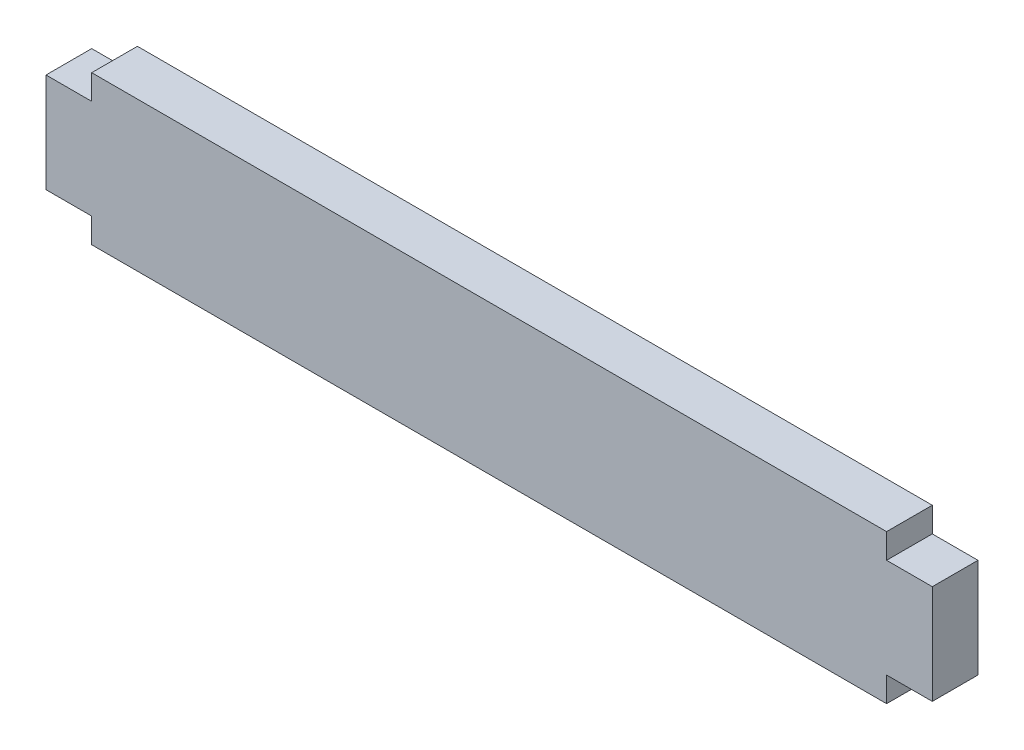
ISO-10303-21;
HEADER;
FILE_DESCRIPTION(('STEP AP214'),'2;1');
FILE_NAME('part.step','',(''),(''),'','','');
FILE_SCHEMA(('AUTOMOTIVE_DESIGN { 1 0 10303 214 1 1 1 1 }'));
ENDSEC;
DATA;
#1=APPLICATION_CONTEXT('core data for automotive mechanical design processes');
#2=APPLICATION_PROTOCOL_DEFINITION('international standard','automotive_design',2000,#1);
#3=PRODUCT_CONTEXT('',#1,'mechanical');
#4=PRODUCT('Part','Part','',(#3));
#5=PRODUCT_RELATED_PRODUCT_CATEGORY('part','',(#4));
#6=PRODUCT_DEFINITION_FORMATION('','',#4);
#7=PRODUCT_DEFINITION_CONTEXT('part definition',#1,'design');
#8=PRODUCT_DEFINITION('design','',#6,#7);
#9=PRODUCT_DEFINITION_SHAPE('','',#8);
#10=(LENGTH_UNIT() NAMED_UNIT(*) SI_UNIT(.MILLI.,.METRE.));
#11=(NAMED_UNIT(*) PLANE_ANGLE_UNIT() SI_UNIT($,.RADIAN.));
#12=(NAMED_UNIT(*) SI_UNIT($,.STERADIAN.) SOLID_ANGLE_UNIT());
#13=UNCERTAINTY_MEASURE_WITH_UNIT(LENGTH_MEASURE(1.E-05),#10,'distance_accuracy_value','');
#14=(GEOMETRIC_REPRESENTATION_CONTEXT(3) GLOBAL_UNCERTAINTY_ASSIGNED_CONTEXT((#13)) GLOBAL_UNIT_ASSIGNED_CONTEXT((#10,
#11,#12)) REPRESENTATION_CONTEXT('',''));
#15=CARTESIAN_POINT('',(0.,0.,0.));
#16=DIRECTION('',(0.,0.,1.));
#17=DIRECTION('',(1.,0.,0.));
#18=AXIS2_PLACEMENT_3D('',#15,#16,#17);
#19=CARTESIAN_POINT('',(0.,6.35,5.842));
#20=DIRECTION('',(0.,-1.,0.));
#21=DIRECTION('',(0.,0.,-1.));
#22=AXIS2_PLACEMENT_3D('',#19,#20,#21);
#23=PLANE('',#22);
#24=DIRECTION('',(-1.,0.,0.));
#25=VECTOR('',#24,1.);
#26=CARTESIAN_POINT('',(0.,6.35,0.));
#27=LINE('',#26,#25);
#28=CARTESIAN_POINT('',(56.642,6.35,0.));
#29=VERTEX_POINT('',#28);
#30=CARTESIAN_POINT('',(50.8,6.35,0.));
#31=VERTEX_POINT('',#30);
#32=EDGE_CURVE('E154',#29,#31,#27,.T.);
#33=ORIENTED_EDGE('',*,*,#32,.T.);
#34=DIRECTION('',(0.,0.,-1.));
#35=VECTOR('',#34,1.);
#36=CARTESIAN_POINT('',(50.8,6.35,5.842));
#37=LINE('',#36,#35);
#38=CARTESIAN_POINT('',(50.8,6.35,5.842));
#39=VERTEX_POINT('',#38);
#40=EDGE_CURVE('E11',#39,#31,#37,.T.);
#41=ORIENTED_EDGE('',*,*,#40,.F.);
#42=DIRECTION('',(-1.,0.,0.));
#43=VECTOR('',#42,1.);
#44=CARTESIAN_POINT('',(0.,6.35,5.842));
#45=LINE('',#44,#43);
#46=CARTESIAN_POINT('',(56.642,6.35,5.842));
#47=VERTEX_POINT('',#46);
#48=EDGE_CURVE('E184',#47,#39,#45,.T.);
#49=ORIENTED_EDGE('',*,*,#48,.F.);
#50=DIRECTION('',(0.,0.,-1.));
#51=VECTOR('',#50,1.);
#52=CARTESIAN_POINT('',(56.642,6.35,5.842));
#53=LINE('',#52,#51);
#54=EDGE_CURVE('E150',#47,#29,#53,.T.);
#55=ORIENTED_EDGE('',*,*,#54,.T.);
#56=EDGE_LOOP('',(#33,#41,#49,#55));
#57=FACE_BOUND('',#56,.T.);
#58=ADVANCED_FACE('F35',(#57),#23,.F.);
#59=CARTESIAN_POINT('',(50.7999999999999,-1.11022302462516E-13,5.842));
#60=DIRECTION('',(-1.,0.,0.));
#61=DIRECTION('',(0.,-1.,0.));
#62=AXIS2_PLACEMENT_3D('',#59,#60,#61);
#63=PLANE('',#62);
#64=DIRECTION('',(0.,1.,0.));
#65=VECTOR('',#64,1.);
#66=CARTESIAN_POINT('',(50.7999999999999,-1.11022302462516E-13,0.));
#67=LINE('',#66,#65);
#68=CARTESIAN_POINT('',(50.8,9.525,0.));
#69=VERTEX_POINT('',#68);
#70=EDGE_CURVE('E157',#31,#69,#67,.T.);
#71=ORIENTED_EDGE('',*,*,#70,.T.);
#72=DIRECTION('',(0.,0.,-1.));
#73=VECTOR('',#72,1.);
#74=CARTESIAN_POINT('',(50.8,9.525,5.842));
#75=LINE('',#74,#73);
#76=CARTESIAN_POINT('',(50.8,9.525,5.842));
#77=VERTEX_POINT('',#76);
#78=EDGE_CURVE('E43',#77,#69,#75,.T.);
#79=ORIENTED_EDGE('',*,*,#78,.F.);
#80=DIRECTION('',(0.,1.,0.));
#81=VECTOR('',#80,1.);
#82=CARTESIAN_POINT('',(50.7999999999999,-1.11022302462516E-13,5.842));
#83=LINE('',#82,#81);
#84=EDGE_CURVE('E102',#39,#77,#83,.T.);
#85=ORIENTED_EDGE('',*,*,#84,.F.);
#86=ORIENTED_EDGE('',*,*,#40,.T.);
#87=EDGE_LOOP('',(#71,#79,#85,#86));
#88=FACE_BOUND('',#87,.T.);
#89=ADVANCED_FACE('F249',(#88),#63,.F.);
#90=CARTESIAN_POINT('',(0.,9.52499999999999,5.842));
#91=DIRECTION('',(0.,-1.,0.));
#92=DIRECTION('',(1.,0.,0.));
#93=AXIS2_PLACEMENT_3D('',#90,#91,#92);
#94=PLANE('',#93);
#95=DIRECTION('',(-1.,0.,0.));
#96=VECTOR('',#95,1.);
#97=CARTESIAN_POINT('',(0.,9.52499999999999,0.));
#98=LINE('',#97,#96);
#99=CARTESIAN_POINT('',(-50.8,9.52499999999998,0.));
#100=VERTEX_POINT('',#99);
#101=EDGE_CURVE('E159',#69,#100,#98,.T.);
#102=ORIENTED_EDGE('',*,*,#101,.T.);
#103=DIRECTION('',(0.,0.,-1.));
#104=VECTOR('',#103,1.);
#105=CARTESIAN_POINT('',(-50.8,9.52499999999998,5.842));
#106=LINE('',#105,#104);
#107=CARTESIAN_POINT('',(-50.8,9.52499999999998,5.842));
#108=VERTEX_POINT('',#107);
#109=EDGE_CURVE('E198',#108,#100,#106,.T.);
#110=ORIENTED_EDGE('',*,*,#109,.F.);
#111=DIRECTION('',(-1.,0.,0.));
#112=VECTOR('',#111,1.);
#113=CARTESIAN_POINT('',(0.,9.52499999999999,5.842));
#114=LINE('',#113,#112);
#115=EDGE_CURVE('E205',#77,#108,#114,.T.);
#116=ORIENTED_EDGE('',*,*,#115,.F.);
#117=ORIENTED_EDGE('',*,*,#78,.T.);
#118=EDGE_LOOP('',(#102,#110,#116,#117));
#119=FACE_BOUND('',#118,.T.);
#120=ADVANCED_FACE('F203',(#119),#94,.F.);
#121=CARTESIAN_POINT('',(-50.8,0.,5.842));
#122=DIRECTION('',(-1.,0.,0.));
#123=DIRECTION('',(0.,0.,1.));
#124=AXIS2_PLACEMENT_3D('',#121,#122,#123);
#125=PLANE('',#124);
#126=DIRECTION('',(0.,1.,0.));
#127=VECTOR('',#126,1.);
#128=CARTESIAN_POINT('',(-50.8,0.,0.));
#129=LINE('',#128,#127);
#130=CARTESIAN_POINT('',(-50.8,6.35,0.));
#131=VERTEX_POINT('',#130);
#132=EDGE_CURVE('E162',#131,#100,#129,.T.);
#133=ORIENTED_EDGE('',*,*,#132,.F.);
#134=DIRECTION('',(0.,0.,-1.));
#135=VECTOR('',#134,1.);
#136=CARTESIAN_POINT('',(-50.8,6.35,5.842));
#137=LINE('',#136,#135);
#138=CARTESIAN_POINT('',(-50.8,6.35,5.842));
#139=VERTEX_POINT('',#138);
#140=EDGE_CURVE('E196',#139,#131,#137,.T.);
#141=ORIENTED_EDGE('',*,*,#140,.F.);
#142=DIRECTION('',(0.,1.,0.));
#143=VECTOR('',#142,1.);
#144=CARTESIAN_POINT('',(-50.8,0.,5.842));
#145=LINE('',#144,#143);
#146=EDGE_CURVE('E215',#139,#108,#145,.T.);
#147=ORIENTED_EDGE('',*,*,#146,.T.);
#148=ORIENTED_EDGE('',*,*,#109,.T.);
#149=EDGE_LOOP('',(#133,#141,#147,#148));
#150=FACE_BOUND('',#149,.T.);
#151=ADVANCED_FACE('F212',(#150),#125,.T.);
#152=CARTESIAN_POINT('',(0.,6.35,5.842));
#153=DIRECTION('',(0.,1.,0.));
#154=DIRECTION('',(0.,0.,1.));
#155=AXIS2_PLACEMENT_3D('',#152,#153,#154);
#156=PLANE('',#155);
#157=DIRECTION('',(1.,0.,0.));
#158=VECTOR('',#157,1.);
#159=CARTESIAN_POINT('',(0.,6.35,0.));
#160=LINE('',#159,#158);
#161=CARTESIAN_POINT('',(-56.642,6.35,0.));
#162=VERTEX_POINT('',#161);
#163=EDGE_CURVE('E165',#162,#131,#160,.T.);
#164=ORIENTED_EDGE('',*,*,#163,.F.);
#165=DIRECTION('',(0.,0.,-1.));
#166=VECTOR('',#165,1.);
#167=CARTESIAN_POINT('',(-56.642,6.35,5.842));
#168=LINE('',#167,#166);
#169=CARTESIAN_POINT('',(-56.642,6.35,5.842));
#170=VERTEX_POINT('',#169);
#171=EDGE_CURVE('E194',#170,#162,#168,.T.);
#172=ORIENTED_EDGE('',*,*,#171,.F.);
#173=DIRECTION('',(1.,0.,0.));
#174=VECTOR('',#173,1.);
#175=CARTESIAN_POINT('',(0.,6.35,5.842));
#176=LINE('',#175,#174);
#177=EDGE_CURVE('E218',#170,#139,#176,.T.);
#178=ORIENTED_EDGE('',*,*,#177,.T.);
#179=ORIENTED_EDGE('',*,*,#140,.T.);
#180=EDGE_LOOP('',(#164,#172,#178,#179));
#181=FACE_BOUND('',#180,.T.);
#182=ADVANCED_FACE('F260',(#181),#156,.T.);
#183=CARTESIAN_POINT('',(-56.642,0.,5.842));
#184=DIRECTION('',(-1.,0.,0.));
#185=DIRECTION('',(0.,0.,1.));
#186=AXIS2_PLACEMENT_3D('',#183,#184,#185);
#187=PLANE('',#186);
#188=DIRECTION('',(0.,1.,0.));
#189=VECTOR('',#188,1.);
#190=CARTESIAN_POINT('',(-56.642,0.,0.));
#191=LINE('',#190,#189);
#192=CARTESIAN_POINT('',(-56.642,-6.35,0.));
#193=VERTEX_POINT('',#192);
#194=EDGE_CURVE('E168',#193,#162,#191,.T.);
#195=ORIENTED_EDGE('',*,*,#194,.F.);
#196=DIRECTION('',(0.,0.,-1.));
#197=VECTOR('',#196,1.);
#198=CARTESIAN_POINT('',(-56.642,-6.35,5.842));
#199=LINE('',#198,#197);
#200=CARTESIAN_POINT('',(-56.642,-6.35,5.842));
#201=VERTEX_POINT('',#200);
#202=EDGE_CURVE('E192',#201,#193,#199,.T.);
#203=ORIENTED_EDGE('',*,*,#202,.F.);
#204=DIRECTION('',(0.,1.,0.));
#205=VECTOR('',#204,1.);
#206=CARTESIAN_POINT('',(-56.642,0.,5.842));
#207=LINE('',#206,#205);
#208=EDGE_CURVE('E220',#201,#170,#207,.T.);
#209=ORIENTED_EDGE('',*,*,#208,.T.);
#210=ORIENTED_EDGE('',*,*,#171,.T.);
#211=EDGE_LOOP('',(#195,#203,#209,#210));
#212=FACE_BOUND('',#211,.T.);
#213=ADVANCED_FACE('F263',(#212),#187,.T.);
#214=CARTESIAN_POINT('',(0.,-6.35,5.842));
#215=DIRECTION('',(0.,1.,0.));
#216=DIRECTION('',(0.,0.,1.));
#217=AXIS2_PLACEMENT_3D('',#214,#215,#216);
#218=PLANE('',#217);
#219=DIRECTION('',(1.,0.,0.));
#220=VECTOR('',#219,1.);
#221=CARTESIAN_POINT('',(0.,-6.35,0.));
#222=LINE('',#221,#220);
#223=CARTESIAN_POINT('',(-50.8,-6.35,0.));
#224=VERTEX_POINT('',#223);
#225=EDGE_CURVE('E171',#193,#224,#222,.T.);
#226=ORIENTED_EDGE('',*,*,#225,.T.);
#227=DIRECTION('',(0.,0.,-1.));
#228=VECTOR('',#227,1.);
#229=CARTESIAN_POINT('',(-50.8,-6.35,5.842));
#230=LINE('',#229,#228);
#231=CARTESIAN_POINT('',(-50.8,-6.35,5.842));
#232=VERTEX_POINT('',#231);
#233=EDGE_CURVE('E190',#232,#224,#230,.T.);
#234=ORIENTED_EDGE('',*,*,#233,.F.);
#235=DIRECTION('',(1.,0.,0.));
#236=VECTOR('',#235,1.);
#237=CARTESIAN_POINT('',(0.,-6.35,5.842));
#238=LINE('',#237,#236);
#239=EDGE_CURVE('E227',#201,#232,#238,.T.);
#240=ORIENTED_EDGE('',*,*,#239,.F.);
#241=ORIENTED_EDGE('',*,*,#202,.T.);
#242=EDGE_LOOP('',(#226,#234,#240,#241));
#243=FACE_BOUND('',#242,.T.);
#244=ADVANCED_FACE('F267',(#243),#218,.F.);
#245=CARTESIAN_POINT('',(-50.8,0.,5.842));
#246=DIRECTION('',(-1.,0.,0.));
#247=DIRECTION('',(0.,0.,1.));
#248=AXIS2_PLACEMENT_3D('',#245,#246,#247);
#249=PLANE('',#248);
#250=DIRECTION('',(0.,1.,0.));
#251=VECTOR('',#250,1.);
#252=CARTESIAN_POINT('',(-50.8,0.,0.));
#253=LINE('',#252,#251);
#254=CARTESIAN_POINT('',(-50.8,-9.52500000000001,0.));
#255=VERTEX_POINT('',#254);
#256=EDGE_CURVE('E174',#255,#224,#253,.T.);
#257=ORIENTED_EDGE('',*,*,#256,.F.);
#258=DIRECTION('',(0.,0.,-1.));
#259=VECTOR('',#258,1.);
#260=CARTESIAN_POINT('',(-50.8,-9.52500000000001,5.842));
#261=LINE('',#260,#259);
#262=CARTESIAN_POINT('',(-50.8,-9.52500000000001,5.842));
#263=VERTEX_POINT('',#262);
#264=EDGE_CURVE('E188',#263,#255,#261,.T.);
#265=ORIENTED_EDGE('',*,*,#264,.F.);
#266=DIRECTION('',(0.,1.,0.));
#267=VECTOR('',#266,1.);
#268=CARTESIAN_POINT('',(-50.8,0.,5.842));
#269=LINE('',#268,#267);
#270=EDGE_CURVE('E229',#263,#232,#269,.T.);
#271=ORIENTED_EDGE('',*,*,#270,.T.);
#272=ORIENTED_EDGE('',*,*,#233,.T.);
#273=EDGE_LOOP('',(#257,#265,#271,#272));
#274=FACE_BOUND('',#273,.T.);
#275=ADVANCED_FACE('F271',(#274),#249,.T.);
#276=CARTESIAN_POINT('',(0.,-9.525,5.842));
#277=DIRECTION('',(0.,-1.,0.));
#278=DIRECTION('',(1.,0.,0.));
#279=AXIS2_PLACEMENT_3D('',#276,#277,#278);
#280=PLANE('',#279);
#281=DIRECTION('',(-1.,0.,0.));
#282=VECTOR('',#281,1.);
#283=CARTESIAN_POINT('',(0.,-9.525,0.));
#284=LINE('',#283,#282);
#285=CARTESIAN_POINT('',(50.8,-9.525,0.));
#286=VERTEX_POINT('',#285);
#287=EDGE_CURVE('E177',#286,#255,#284,.T.);
#288=ORIENTED_EDGE('',*,*,#287,.F.);
#289=DIRECTION('',(0.,0.,-1.));
#290=VECTOR('',#289,1.);
#291=CARTESIAN_POINT('',(50.8,-9.525,5.842));
#292=LINE('',#291,#290);
#293=CARTESIAN_POINT('',(50.8,-9.525,5.842));
#294=VERTEX_POINT('',#293);
#295=EDGE_CURVE('E146',#294,#286,#292,.T.);
#296=ORIENTED_EDGE('',*,*,#295,.F.);
#297=DIRECTION('',(-1.,0.,0.));
#298=VECTOR('',#297,1.);
#299=CARTESIAN_POINT('',(0.,-9.525,5.842));
#300=LINE('',#299,#298);
#301=EDGE_CURVE('E135',#294,#263,#300,.T.);
#302=ORIENTED_EDGE('',*,*,#301,.T.);
#303=ORIENTED_EDGE('',*,*,#264,.T.);
#304=EDGE_LOOP('',(#288,#296,#302,#303));
#305=FACE_BOUND('',#304,.T.);
#306=ADVANCED_FACE('F233',(#305),#280,.T.);
#307=CARTESIAN_POINT('',(50.7999999999999,1.11022302462516E-13,5.842));
#308=DIRECTION('',(-1.,0.,0.));
#309=DIRECTION('',(0.,-1.,0.));
#310=AXIS2_PLACEMENT_3D('',#307,#308,#309);
#311=PLANE('',#310);
#312=DIRECTION('',(0.,1.,0.));
#313=VECTOR('',#312,1.);
#314=CARTESIAN_POINT('',(50.7999999999999,1.11022302462516E-13,0.));
#315=LINE('',#314,#313);
#316=CARTESIAN_POINT('',(50.8,-6.35,0.));
#317=VERTEX_POINT('',#316);
#318=EDGE_CURVE('E142',#286,#317,#315,.T.);
#319=ORIENTED_EDGE('',*,*,#318,.T.);
#320=DIRECTION('',(0.,0.,-1.));
#321=VECTOR('',#320,1.);
#322=CARTESIAN_POINT('',(50.8,-6.35,5.842));
#323=LINE('',#322,#321);
#324=CARTESIAN_POINT('',(50.8,-6.35,5.842));
#325=VERTEX_POINT('',#324);
#326=EDGE_CURVE('E139',#325,#317,#323,.T.);
#327=ORIENTED_EDGE('',*,*,#326,.F.);
#328=DIRECTION('',(0.,1.,0.));
#329=VECTOR('',#328,1.);
#330=CARTESIAN_POINT('',(50.7999999999999,1.11022302462516E-13,5.842));
#331=LINE('',#330,#329);
#332=EDGE_CURVE('E128',#294,#325,#331,.T.);
#333=ORIENTED_EDGE('',*,*,#332,.F.);
#334=ORIENTED_EDGE('',*,*,#295,.T.);
#335=EDGE_LOOP('',(#319,#327,#333,#334));
#336=FACE_BOUND('',#335,.T.);
#337=ADVANCED_FACE('F140',(#336),#311,.F.);
#338=CARTESIAN_POINT('',(0.,-6.35,5.842));
#339=DIRECTION('',(0.,-1.,0.));
#340=DIRECTION('',(0.,0.,-1.));
#341=AXIS2_PLACEMENT_3D('',#338,#339,#340);
#342=PLANE('',#341);
#343=DIRECTION('',(-1.,0.,0.));
#344=VECTOR('',#343,1.);
#345=CARTESIAN_POINT('',(0.,-6.35,0.));
#346=LINE('',#345,#344);
#347=CARTESIAN_POINT('',(56.642,-6.35,0.));
#348=VERTEX_POINT('',#347);
#349=EDGE_CURVE('E181',#348,#317,#346,.T.);
#350=ORIENTED_EDGE('',*,*,#349,.F.);
#351=DIRECTION('',(0.,0.,-1.));
#352=VECTOR('',#351,1.);
#353=CARTESIAN_POINT('',(56.642,-6.35,5.842));
#354=LINE('',#353,#352);
#355=CARTESIAN_POINT('',(56.642,-6.35,5.842));
#356=VERTEX_POINT('',#355);
#357=EDGE_CURVE('E91',#356,#348,#354,.T.);
#358=ORIENTED_EDGE('',*,*,#357,.F.);
#359=DIRECTION('',(-1.,0.,0.));
#360=VECTOR('',#359,1.);
#361=CARTESIAN_POINT('',(0.,-6.35,5.842));
#362=LINE('',#361,#360);
#363=EDGE_CURVE('E132',#356,#325,#362,.T.);
#364=ORIENTED_EDGE('',*,*,#363,.T.);
#365=ORIENTED_EDGE('',*,*,#326,.T.);
#366=EDGE_LOOP('',(#350,#358,#364,#365));
#367=FACE_BOUND('',#366,.T.);
#368=ADVANCED_FACE('F148',(#367),#342,.T.);
#369=CARTESIAN_POINT('',(56.642,0.,5.842));
#370=DIRECTION('',(-1.,0.,0.));
#371=DIRECTION('',(0.,0.,1.));
#372=AXIS2_PLACEMENT_3D('',#369,#370,#371);
#373=PLANE('',#372);
#374=DIRECTION('',(0.,1.,0.));
#375=VECTOR('',#374,1.);
#376=CARTESIAN_POINT('',(56.642,0.,0.));
#377=LINE('',#376,#375);
#378=EDGE_CURVE('E94',#348,#29,#377,.T.);
#379=ORIENTED_EDGE('',*,*,#378,.T.);
#380=ORIENTED_EDGE('',*,*,#54,.F.);
#381=DIRECTION('',(0.,1.,0.));
#382=VECTOR('',#381,1.);
#383=CARTESIAN_POINT('',(56.642,0.,5.842));
#384=LINE('',#383,#382);
#385=EDGE_CURVE('E51',#356,#47,#384,.T.);
#386=ORIENTED_EDGE('',*,*,#385,.F.);
#387=ORIENTED_EDGE('',*,*,#357,.T.);
#388=EDGE_LOOP('',(#379,#380,#386,#387));
#389=FACE_BOUND('',#388,.T.);
#390=ADVANCED_FACE('F238',(#389),#373,.F.);
#391=CARTESIAN_POINT('',(0.,0.,5.842));
#392=DIRECTION('',(0.,0.,1.));
#393=DIRECTION('',(1.,0.,0.));
#394=AXIS2_PLACEMENT_3D('',#391,#392,#393);
#395=PLANE('',#394);
#396=ORIENTED_EDGE('',*,*,#48,.T.);
#397=ORIENTED_EDGE('',*,*,#84,.T.);
#398=ORIENTED_EDGE('',*,*,#115,.T.);
#399=ORIENTED_EDGE('',*,*,#146,.F.);
#400=ORIENTED_EDGE('',*,*,#177,.F.);
#401=ORIENTED_EDGE('',*,*,#208,.F.);
#402=ORIENTED_EDGE('',*,*,#239,.T.);
#403=ORIENTED_EDGE('',*,*,#270,.F.);
#404=ORIENTED_EDGE('',*,*,#301,.F.);
#405=ORIENTED_EDGE('',*,*,#332,.T.);
#406=ORIENTED_EDGE('',*,*,#363,.F.);
#407=ORIENTED_EDGE('',*,*,#385,.T.);
#408=EDGE_LOOP('',(#396,#397,#398,#399,#400,#401,#402,#403,#404,#405,#406,#407));
#409=FACE_BOUND('',#408,.T.);
#410=ADVANCED_FACE('F130',(#409),#395,.T.);
#411=CARTESIAN_POINT('',(0.,0.,0.));
#412=DIRECTION('',(0.,0.,1.));
#413=DIRECTION('',(1.,0.,0.));
#414=AXIS2_PLACEMENT_3D('',#411,#412,#413);
#415=PLANE('',#414);
#416=ORIENTED_EDGE('',*,*,#32,.F.);
#417=ORIENTED_EDGE('',*,*,#378,.F.);
#418=ORIENTED_EDGE('',*,*,#349,.T.);
#419=ORIENTED_EDGE('',*,*,#318,.F.);
#420=ORIENTED_EDGE('',*,*,#287,.T.);
#421=ORIENTED_EDGE('',*,*,#256,.T.);
#422=ORIENTED_EDGE('',*,*,#225,.F.);
#423=ORIENTED_EDGE('',*,*,#194,.T.);
#424=ORIENTED_EDGE('',*,*,#163,.T.);
#425=ORIENTED_EDGE('',*,*,#132,.T.);
#426=ORIENTED_EDGE('',*,*,#101,.F.);
#427=ORIENTED_EDGE('',*,*,#70,.F.);
#428=EDGE_LOOP('',(#416,#417,#418,#419,#420,#421,#422,#423,#424,#425,#426,#427));
#429=FACE_BOUND('',#428,.T.);
#430=ADVANCED_FACE('F208',(#429),#415,.F.);
#431=CLOSED_SHELL('',(#58,#89,#120,#151,#182,#213,#244,#275,#306,#337,#368,#390,#410,#430));
#432=MANIFOLD_SOLID_BREP('B2',#431);
#433=ADVANCED_BREP_SHAPE_REPRESENTATION('',(#18,#432),#14);
#434=SHAPE_DEFINITION_REPRESENTATION(#9,#433);
ENDSEC;
END-ISO-10303-21;
